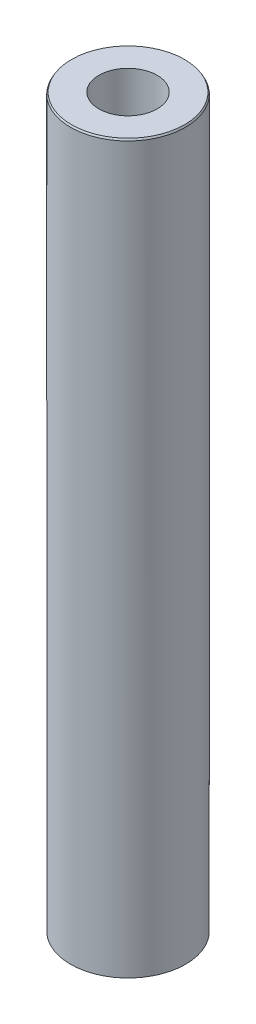
ISO-10303-21;
HEADER;
FILE_DESCRIPTION(('STEP AP214'),'2;1');
FILE_NAME('part.step','',(''),(''),'','','');
FILE_SCHEMA(('AUTOMOTIVE_DESIGN { 1 0 10303 214 1 1 1 1 }'));
ENDSEC;
DATA;
#1=APPLICATION_CONTEXT('core data for automotive mechanical design processes');
#2=APPLICATION_PROTOCOL_DEFINITION('international standard','automotive_design',2000,#1);
#3=PRODUCT_CONTEXT('',#1,'mechanical');
#4=PRODUCT('Part','Part','',(#3));
#5=PRODUCT_RELATED_PRODUCT_CATEGORY('part','',(#4));
#6=PRODUCT_DEFINITION_FORMATION('','',#4);
#7=PRODUCT_DEFINITION_CONTEXT('part definition',#1,'design');
#8=PRODUCT_DEFINITION('design','',#6,#7);
#9=PRODUCT_DEFINITION_SHAPE('','',#8);
#10=(LENGTH_UNIT() NAMED_UNIT(*) SI_UNIT(.MILLI.,.METRE.));
#11=(NAMED_UNIT(*) PLANE_ANGLE_UNIT() SI_UNIT($,.RADIAN.));
#12=(NAMED_UNIT(*) SI_UNIT($,.STERADIAN.) SOLID_ANGLE_UNIT());
#13=UNCERTAINTY_MEASURE_WITH_UNIT(LENGTH_MEASURE(1.E-05),#10,'distance_accuracy_value','');
#14=(GEOMETRIC_REPRESENTATION_CONTEXT(3) GLOBAL_UNCERTAINTY_ASSIGNED_CONTEXT((#13)) GLOBAL_UNIT_ASSIGNED_CONTEXT((#10,
#11,#12)) REPRESENTATION_CONTEXT('',''));
#15=CARTESIAN_POINT('',(0.,0.,0.));
#16=DIRECTION('',(0.,0.,1.));
#17=DIRECTION('',(1.,0.,0.));
#18=AXIS2_PLACEMENT_3D('',#15,#16,#17);
#19=CARTESIAN_POINT('',(0.,94.8705525720366,0.));
#20=DIRECTION('',(0.,-1.,0.));
#21=DIRECTION('',(0.,0.,-1.));
#22=AXIS2_PLACEMENT_3D('',#19,#20,#21);
#23=CYLINDRICAL_SURFACE('',#22,7.5);
#24=CARTESIAN_POINT('',(0.,94.6469400016437,0.));
#25=DIRECTION('',(0.,1.,0.));
#26=DIRECTION('',(0.,0.,1.));
#27=AXIS2_PLACEMENT_3D('',#24,#25,#26);
#28=CIRCLE('',#27,7.5);
#29=CARTESIAN_POINT('',(0.,94.6469400016437,-7.5));
#30=VERTEX_POINT('',#29);
#31=EDGE_CURVE('E50',#30,#30,#28,.F.);
#32=CARTESIAN_POINT('',(0.,0.129102777710624,0.));
#33=DIRECTION('',(0.,1.,0.));
#34=DIRECTION('',(0.,0.,1.));
#35=AXIS2_PLACEMENT_3D('',#32,#33,#34);
#36=CIRCLE('',#35,7.5);
#37=CARTESIAN_POINT('',(0.,0.12910277771061,-7.5));
#38=VERTEX_POINT('',#37);
#39=EDGE_CURVE('E51',#38,#38,#36,.T.);
#40=CARTESIAN_POINT('',(0.,94.6469400016437,-7.5));
#41=CARTESIAN_POINT('',(0.,93.6623791972277,-7.5));
#42=CARTESIAN_POINT('',(0.,92.6778183928117,-7.5));
#43=CARTESIAN_POINT('',(0.,90.7086967839798,-7.5));
#44=CARTESIAN_POINT('',(0.,89.7241359795638,-7.5));
#45=CARTESIAN_POINT('',(0.,87.7550143707319,-7.5));
#46=CARTESIAN_POINT('',(0.,86.7704535663159,-7.5));
#47=CARTESIAN_POINT('',(0.,84.801331957484,-7.5));
#48=CARTESIAN_POINT('',(0.,83.816771153068,-7.5));
#49=CARTESIAN_POINT('',(0.,81.8476495442361,-7.5));
#50=CARTESIAN_POINT('',(0.,80.8630887398201,-7.5));
#51=CARTESIAN_POINT('',(0.,78.8939671309882,-7.5));
#52=CARTESIAN_POINT('',(0.,77.9094063265722,-7.5));
#53=CARTESIAN_POINT('',(0.,75.9402847177403,-7.5));
#54=CARTESIAN_POINT('',(0.,74.9557239133243,-7.5));
#55=CARTESIAN_POINT('',(0.,72.9866023044924,-7.5));
#56=CARTESIAN_POINT('',(0.,72.0020415000764,-7.5));
#57=CARTESIAN_POINT('',(0.,70.0329198912444,-7.5));
#58=CARTESIAN_POINT('',(0.,69.0483590868285,-7.5));
#59=CARTESIAN_POINT('',(0.,67.0792374779965,-7.5));
#60=CARTESIAN_POINT('',(0.,66.0946766735806,-7.5));
#61=CARTESIAN_POINT('',(0.,64.1255550647486,-7.5));
#62=CARTESIAN_POINT('',(0.,63.1409942603326,-7.5));
#63=CARTESIAN_POINT('',(0.,61.1718726515007,-7.5));
#64=CARTESIAN_POINT('',(0.,60.1873118470847,-7.5));
#65=CARTESIAN_POINT('',(0.,58.2181902382528,-7.5));
#66=CARTESIAN_POINT('',(0.,57.2336294338368,-7.5));
#67=CARTESIAN_POINT('',(0.,55.2645078250049,-7.5));
#68=CARTESIAN_POINT('',(0.,54.2799470205889,-7.5));
#69=CARTESIAN_POINT('',(0.,52.310825411757,-7.5));
#70=CARTESIAN_POINT('',(0.,51.326264607341,-7.5));
#71=CARTESIAN_POINT('',(0.,49.3571429985091,-7.5));
#72=CARTESIAN_POINT('',(0.,48.3725821940931,-7.5));
#73=CARTESIAN_POINT('',(0.,46.4034605852612,-7.5));
#74=CARTESIAN_POINT('',(0.,45.4188997808452,-7.5));
#75=CARTESIAN_POINT('',(0.,43.4497781720133,-7.5));
#76=CARTESIAN_POINT('',(0.,42.4652173675973,-7.5));
#77=CARTESIAN_POINT('',(0.,40.4960957587653,-7.5));
#78=CARTESIAN_POINT('',(0.,39.5115349543494,-7.5));
#79=CARTESIAN_POINT('',(0.,37.5424133455174,-7.5));
#80=CARTESIAN_POINT('',(0.,36.5578525411015,-7.5));
#81=CARTESIAN_POINT('',(0.,34.5887309322695,-7.5));
#82=CARTESIAN_POINT('',(0.,33.6041701278536,-7.5));
#83=CARTESIAN_POINT('',(0.,31.6350485190216,-7.5));
#84=CARTESIAN_POINT('',(0.,30.6504877146057,-7.5));
#85=CARTESIAN_POINT('',(0.,28.6813661057737,-7.5));
#86=CARTESIAN_POINT('',(0.,27.6968053013578,-7.5));
#87=CARTESIAN_POINT('',(0.,25.7276836925258,-7.5));
#88=CARTESIAN_POINT('',(0.,24.7431228881098,-7.5));
#89=CARTESIAN_POINT('',(0.,22.7740012792779,-7.5));
#90=CARTESIAN_POINT('',(0.,21.7894404748619,-7.5));
#91=CARTESIAN_POINT('',(0.,19.82031886603,-7.5));
#92=CARTESIAN_POINT('',(0.,18.835758061614,-7.5));
#93=CARTESIAN_POINT('',(0.,16.8666364527821,-7.5));
#94=CARTESIAN_POINT('',(0.,15.8820756483661,-7.5));
#95=CARTESIAN_POINT('',(0.,13.9129540395342,-7.5));
#96=CARTESIAN_POINT('',(0.,12.9283932351182,-7.5));
#97=CARTESIAN_POINT('',(0.,10.9592716262863,-7.5));
#98=CARTESIAN_POINT('',(0.,9.97471082187029,-7.5));
#99=CARTESIAN_POINT('',(0.,8.00558921303835,-7.5));
#100=CARTESIAN_POINT('',(0.,7.02102840862239,-7.5));
#101=CARTESIAN_POINT('',(0.,5.05190679979045,-7.5));
#102=CARTESIAN_POINT('',(0.,4.06734599537448,-7.5));
#103=CARTESIAN_POINT('',(0.,2.09822438654254,-7.5));
#104=CARTESIAN_POINT('',(0.,1.11366358212657,-7.5));
#105=CARTESIAN_POINT('',(0.,0.12910277771061,-7.5));
#106=B_SPLINE_CURVE_WITH_KNOTS('',3,(#40,#41,#42,#43,#44,#45,#46,#47,#48,#49,#50,#51,#52,#53,
#54,#55,#56,#57,#58,#59,#60,#61,#62,#63,#64,#65,#66,#67,#68,#69,#70,#71,#72,#73,#74,#75,#76,#77,
#78,#79,#80,#81,#82,#83,#84,#85,#86,#87,#88,#89,#90,#91,#92,#93,#94,#95,#96,#97,#98,#99,#100,
#101,#102,#103,#104,#105),.UNSPECIFIED.,.F.,.F.,(4,2,2,2,2,2,2,2,2,2,2,2,2,2,2,2,2,2,2,2,2,2,2,
2,2,2,2,2,2,2,2,2,4),(0.,2.95368241324792,5.90736482649583,8.86104723974374,11.8147296529916,
14.7684120662396,17.7220944794875,20.6757768927354,23.6294593059833,26.5831417192312,
29.5368241324791,32.490506545727,35.4441889589749,38.3978713722228,41.3515537854707,
44.3052361987186,47.2589186119665,50.2126010252145,53.1662834384624,56.1199658517103,
59.0736482649582,62.0273306782061,64.981013091454,67.9346955047019,70.8883779179498,
73.8420603311977,76.7957427444456,79.7494251576935,82.7031075709414,85.6567899841894,
88.6104723974373,91.5641548106852,94.5178372239331),.UNSPECIFIED.);
#107=EDGE_CURVE('BSEAM39',#30,#38,#106,.T.);
#108=ORIENTED_EDGE('',*,*,#31,.T.);
#109=ORIENTED_EDGE('',*,*,#39,.T.);
#110=ORIENTED_EDGE('',*,*,#107,.T.);
#111=ORIENTED_EDGE('',*,*,#107,.F.);
#112=EDGE_LOOP('',(#108,#110,#109,#111));
#113=FACE_BOUND('',#112,.T.);
#114=ADVANCED_FACE('F39',(#113),#23,.T.);
#115=CARTESIAN_POINT('',(0.,94.8705525720366,0.));
#116=DIRECTION('',(0.,1.,0.));
#117=DIRECTION('',(0.,0.,1.));
#118=AXIS2_PLACEMENT_3D('',#115,#116,#117);
#119=PLANE('',#118);
#120=CARTESIAN_POINT('',(0.,94.8705525720366,0.));
#121=DIRECTION('',(0.,1.,0.));
#122=DIRECTION('',(0.,0.,1.));
#123=AXIS2_PLACEMENT_3D('',#120,#121,#122);
#124=CIRCLE('',#123,7.37089722228947);
#125=CARTESIAN_POINT('',(0.,94.8705525720366,7.37089722228947));
#126=VERTEX_POINT('',#125);
#127=EDGE_CURVE('E54',#126,#126,#124,.T.);
#128=ORIENTED_EDGE('',*,*,#127,.T.);
#129=EDGE_LOOP('',(#128));
#130=FACE_BOUND('',#129,.T.);
#131=CARTESIAN_POINT('',(0.,94.8705525720366,0.));
#132=DIRECTION('',(0.,1.,0.));
#133=DIRECTION('',(0.,0.,1.));
#134=AXIS2_PLACEMENT_3D('',#131,#132,#133);
#135=CIRCLE('',#134,3.80207815019512);
#136=CARTESIAN_POINT('',(0.,94.8705525720366,-3.80207815019512));
#137=VERTEX_POINT('',#136);
#138=EDGE_CURVE('E58',#137,#137,#135,.T.);
#139=ORIENTED_EDGE('',*,*,#138,.F.);
#140=EDGE_LOOP('',(#139));
#141=FACE_BOUND('',#140,.T.);
#142=ADVANCED_FACE('F69',(#130,#141),#119,.T.);
#143=CARTESIAN_POINT('',(0.,0.,0.));
#144=DIRECTION('',(0.,1.,0.));
#145=DIRECTION('',(0.,0.,1.));
#146=AXIS2_PLACEMENT_3D('',#143,#144,#145);
#147=PLANE('',#146);
#148=CARTESIAN_POINT('',(0.,0.,0.));
#149=DIRECTION('',(0.,1.,0.));
#150=DIRECTION('',(0.,0.,1.));
#151=AXIS2_PLACEMENT_3D('',#148,#149,#150);
#152=CIRCLE('',#151,7.27638742960693);
#153=CARTESIAN_POINT('',(0.,0.,7.27638742960693));
#154=VERTEX_POINT('',#153);
#155=EDGE_CURVE('E10',#154,#154,#152,.F.);
#156=ORIENTED_EDGE('',*,*,#155,.T.);
#157=EDGE_LOOP('',(#156));
#158=FACE_BOUND('',#157,.T.);
#159=CARTESIAN_POINT('',(0.,0.,0.));
#160=DIRECTION('',(0.,1.,0.));
#161=DIRECTION('',(0.,0.,1.));
#162=AXIS2_PLACEMENT_3D('',#159,#160,#161);
#163=CIRCLE('',#162,3.80207815019512);
#164=CARTESIAN_POINT('',(0.,0.,-3.80207815019512));
#165=VERTEX_POINT('',#164);
#166=EDGE_CURVE('E63',#165,#165,#163,.T.);
#167=ORIENTED_EDGE('',*,*,#166,.T.);
#168=EDGE_LOOP('',(#167));
#169=FACE_BOUND('',#168,.T.);
#170=ADVANCED_FACE('F75',(#158,#169),#147,.F.);
#171=CARTESIAN_POINT('',(0.,94.8705525720366,0.));
#172=DIRECTION('',(0.,-1.,0.));
#173=DIRECTION('',(0.,0.,-1.));
#174=AXIS2_PLACEMENT_3D('',#171,#172,#173);
#175=CYLINDRICAL_SURFACE('',#174,3.80207815019512);
#176=CARTESIAN_POINT('',(0.,94.8705525720366,-3.80207815019512));
#177=CARTESIAN_POINT('',(0.,93.8823176494112,-3.80207815019512));
#178=CARTESIAN_POINT('',(0.,92.8940827267858,-3.80207815019512));
#179=CARTESIAN_POINT('',(0.,90.9176128815351,-3.80207815019512));
#180=CARTESIAN_POINT('',(0.,89.9293779589097,-3.80207815019512));
#181=CARTESIAN_POINT('',(0.,87.9529081136589,-3.80207815019512));
#182=CARTESIAN_POINT('',(0.,86.9646731910335,-3.80207815019512));
#183=CARTESIAN_POINT('',(0.,84.9882033457828,-3.80207815019512));
#184=CARTESIAN_POINT('',(0.,83.9999684231574,-3.80207815019512));
#185=CARTESIAN_POINT('',(0.,82.0234985779066,-3.80207815019512));
#186=CARTESIAN_POINT('',(0.,81.0352636552813,-3.80207815019512));
#187=CARTESIAN_POINT('',(0.,79.0587938100305,-3.80207815019512));
#188=CARTESIAN_POINT('',(0.,78.0705588874051,-3.80207815019512));
#189=CARTESIAN_POINT('',(0.,76.0940890421544,-3.80207815019512));
#190=CARTESIAN_POINT('',(0.,75.105854119529,-3.80207815019512));
#191=CARTESIAN_POINT('',(0.,73.1293842742782,-3.80207815019512));
#192=CARTESIAN_POINT('',(0.,72.1411493516528,-3.80207815019512));
#193=CARTESIAN_POINT('',(0.,70.1646795064021,-3.80207815019512));
#194=CARTESIAN_POINT('',(0.,69.1764445837767,-3.80207815019512));
#195=CARTESIAN_POINT('',(0.,67.1999747385259,-3.80207815019512));
#196=CARTESIAN_POINT('',(0.,66.2117398159005,-3.80207815019512));
#197=CARTESIAN_POINT('',(0.,64.2352699706498,-3.80207815019512));
#198=CARTESIAN_POINT('',(0.,63.2470350480244,-3.80207815019512));
#199=CARTESIAN_POINT('',(0.,61.2705652027736,-3.80207815019512));
#200=CARTESIAN_POINT('',(0.,60.2823302801483,-3.80207815019512));
#201=CARTESIAN_POINT('',(0.,58.3058604348975,-3.80207815019512));
#202=CARTESIAN_POINT('',(0.,57.3176255122721,-3.80207815019512));
#203=CARTESIAN_POINT('',(0.,55.3411556670213,-3.80207815019512));
#204=CARTESIAN_POINT('',(0.,54.352920744396,-3.80207815019512));
#205=CARTESIAN_POINT('',(0.,52.3764508991452,-3.80207815019512));
#206=CARTESIAN_POINT('',(0.,51.3882159765198,-3.80207815019512));
#207=CARTESIAN_POINT('',(0.,49.4117461312691,-3.80207815019512));
#208=CARTESIAN_POINT('',(0.,48.4235112086437,-3.80207815019512));
#209=CARTESIAN_POINT('',(0.,46.4470413633929,-3.80207815019512));
#210=CARTESIAN_POINT('',(0.,45.4588064407675,-3.80207815019512));
#211=CARTESIAN_POINT('',(0.,43.4823365955168,-3.80207815019512));
#212=CARTESIAN_POINT('',(0.,42.4941016728914,-3.80207815019512));
#213=CARTESIAN_POINT('',(0.,40.5176318276406,-3.80207815019512));
#214=CARTESIAN_POINT('',(0.,39.5293969050153,-3.80207815019512));
#215=CARTESIAN_POINT('',(0.,37.5529270597645,-3.80207815019512));
#216=CARTESIAN_POINT('',(0.,36.5646921371391,-3.80207815019512));
#217=CARTESIAN_POINT('',(0.,34.5882222918883,-3.80207815019512));
#218=CARTESIAN_POINT('',(0.,33.599987369263,-3.80207815019512));
#219=CARTESIAN_POINT('',(0.,31.6235175240122,-3.80207815019512));
#220=CARTESIAN_POINT('',(0.,30.6352826013868,-3.80207815019512));
#221=CARTESIAN_POINT('',(0.,28.6588127561361,-3.80207815019512));
#222=CARTESIAN_POINT('',(0.,27.6705778335107,-3.80207815019512));
#223=CARTESIAN_POINT('',(0.,25.6941079882599,-3.80207815019512));
#224=CARTESIAN_POINT('',(0.,24.7058730656345,-3.80207815019512));
#225=CARTESIAN_POINT('',(0.,22.7294032203838,-3.80207815019512));
#226=CARTESIAN_POINT('',(0.,21.7411682977584,-3.80207815019512));
#227=CARTESIAN_POINT('',(0.,19.7646984525076,-3.80207815019512));
#228=CARTESIAN_POINT('',(0.,18.7764635298822,-3.80207815019512));
#229=CARTESIAN_POINT('',(0.,16.7999936846315,-3.80207815019512));
#230=CARTESIAN_POINT('',(0.,15.8117587620061,-3.80207815019512));
#231=CARTESIAN_POINT('',(0.,13.8352889167553,-3.80207815019512));
#232=CARTESIAN_POINT('',(0.,12.84705399413,-3.80207815019512));
#233=CARTESIAN_POINT('',(0.,10.8705841488792,-3.80207815019512));
#234=CARTESIAN_POINT('',(0.,9.88234922625382,-3.80207815019512));
#235=CARTESIAN_POINT('',(0.,7.90587938100305,-3.80207815019512));
#236=CARTESIAN_POINT('',(0.,6.91764445837767,-3.80207815019512));
#237=CARTESIAN_POINT('',(0.,4.94117461312691,-3.80207815019512));
#238=CARTESIAN_POINT('',(0.,3.95293969050153,-3.80207815019512));
#239=CARTESIAN_POINT('',(0.,1.97646984525077,-3.80207815019512));
#240=CARTESIAN_POINT('',(0.,0.988234922625384,-3.80207815019512));
#241=CARTESIAN_POINT('',(0.,0.,-3.80207815019512));
#242=B_SPLINE_CURVE_WITH_KNOTS('',3,(#176,#177,#178,#179,#180,#181,#182,#183,#184,#185,#186,
#187,#188,#189,#190,#191,#192,#193,#194,#195,#196,#197,#198,#199,#200,#201,#202,#203,#204,#205,
#206,#207,#208,#209,#210,#211,#212,#213,#214,#215,#216,#217,#218,#219,#220,#221,#222,#223,#224,
#225,#226,#227,#228,#229,#230,#231,#232,#233,#234,#235,#236,#237,#238,#239,#240,#241),
.UNSPECIFIED.,.F.,.F.,(4,2,2,2,2,2,2,2,2,2,2,2,2,2,2,2,2,2,2,2,2,2,2,2,2,2,2,2,2,2,2,2,4),(0.,
2.96470476787614,5.92940953575227,8.89411430362842,11.8588190715046,14.8235238393807,
17.7882286072568,20.752933375133,23.7176381430091,26.6823429108853,29.6470476787614,
32.6117524466376,35.5764572145137,38.5411619823899,41.505866750266,44.4705715181421,
47.4352762860183,50.3999810538944,53.3646858217706,56.3293905896467,59.2940953575229,
62.258800125399,65.2235048932751,68.1882096611513,71.1529144290274,74.1176191969036,
77.0823239647797,80.0470287326559,83.011733500532,85.9764382684081,88.9411430362843,
91.9058478041604,94.8705525720366),.UNSPECIFIED.);
#243=EDGE_CURVE('BSEAM70',#137,#165,#242,.T.);
#244=ORIENTED_EDGE('',*,*,#138,.T.);
#245=ORIENTED_EDGE('',*,*,#166,.F.);
#246=ORIENTED_EDGE('',*,*,#243,.T.);
#247=ORIENTED_EDGE('',*,*,#243,.F.);
#248=EDGE_LOOP('',(#244,#246,#245,#247));
#249=FACE_BOUND('',#248,.T.);
#250=ADVANCED_FACE('F70',(#249),#175,.F.);
#251=CARTESIAN_POINT('',(0.,94.8705525720366,0.));
#252=DIRECTION('',(0.,-1.,0.));
#253=DIRECTION('',(0.,0.,-1.));
#254=AXIS2_PLACEMENT_3D('',#251,#252,#253);
#255=CONICAL_SURFACE('',#254,7.37089722228947,0.523598775598309);
#256=ORIENTED_EDGE('',*,*,#31,.F.);
#257=EDGE_LOOP('',(#256));
#258=FACE_BOUND('',#257,.T.);
#259=ORIENTED_EDGE('',*,*,#127,.F.);
#260=EDGE_LOOP('',(#259));
#261=FACE_BOUND('',#260,.T.);
#262=ADVANCED_FACE('F81',(#258,#261),#255,.T.);
#263=CARTESIAN_POINT('',(0.,0.129102777710624,0.));
#264=DIRECTION('',(0.,1.,0.));
#265=DIRECTION('',(0.,0.,1.));
#266=AXIS2_PLACEMENT_3D('',#263,#264,#265);
#267=CONICAL_SURFACE('',#266,7.5,1.0471975511966);
#268=ORIENTED_EDGE('',*,*,#155,.F.);
#269=EDGE_LOOP('',(#268));
#270=FACE_BOUND('',#269,.T.);
#271=ORIENTED_EDGE('',*,*,#39,.F.);
#272=EDGE_LOOP('',(#271));
#273=FACE_BOUND('',#272,.T.);
#274=ADVANCED_FACE('F45',(#270,#273),#267,.T.);
#275=CLOSED_SHELL('',(#114,#142,#170,#250,#262,#274));
#276=MANIFOLD_SOLID_BREP('B2',#275);
#277=ADVANCED_BREP_SHAPE_REPRESENTATION('',(#18,#276),#14);
#278=SHAPE_DEFINITION_REPRESENTATION(#9,#277);
ENDSEC;
END-ISO-10303-21;
